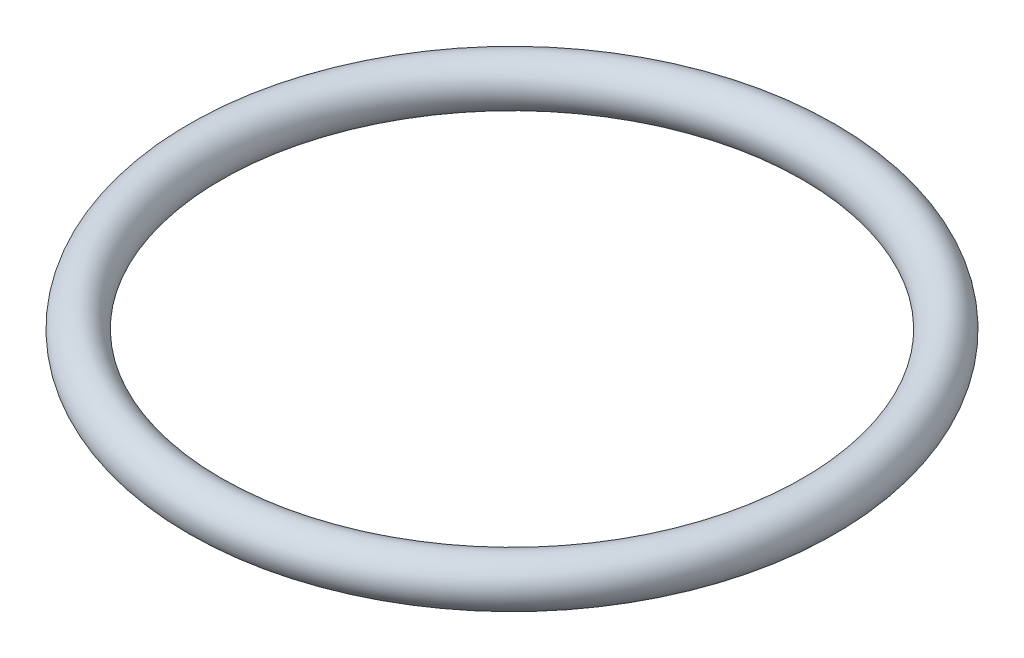
ISO-10303-21;
HEADER;
FILE_DESCRIPTION(('STEP AP214'),'2;1');
FILE_NAME('part.step','',(''),(''),'','','');
FILE_SCHEMA(('AUTOMOTIVE_DESIGN { 1 0 10303 214 1 1 1 1 }'));
ENDSEC;
DATA;
#1=APPLICATION_CONTEXT('core data for automotive mechanical design processes');
#2=APPLICATION_PROTOCOL_DEFINITION('international standard','automotive_design',2000,#1);
#3=PRODUCT_CONTEXT('',#1,'mechanical');
#4=PRODUCT('Part','Part','',(#3));
#5=PRODUCT_RELATED_PRODUCT_CATEGORY('part','',(#4));
#6=PRODUCT_DEFINITION_FORMATION('','',#4);
#7=PRODUCT_DEFINITION_CONTEXT('part definition',#1,'design');
#8=PRODUCT_DEFINITION('design','',#6,#7);
#9=PRODUCT_DEFINITION_SHAPE('','',#8);
#10=(LENGTH_UNIT() NAMED_UNIT(*) SI_UNIT(.MILLI.,.METRE.));
#11=(NAMED_UNIT(*) PLANE_ANGLE_UNIT() SI_UNIT($,.RADIAN.));
#12=(NAMED_UNIT(*) SI_UNIT($,.STERADIAN.) SOLID_ANGLE_UNIT());
#13=UNCERTAINTY_MEASURE_WITH_UNIT(LENGTH_MEASURE(1.E-05),#10,'distance_accuracy_value','');
#14=(GEOMETRIC_REPRESENTATION_CONTEXT(3) GLOBAL_UNCERTAINTY_ASSIGNED_CONTEXT((#13)) GLOBAL_UNIT_ASSIGNED_CONTEXT((#10,
#11,#12)) REPRESENTATION_CONTEXT('',''));
#15=CARTESIAN_POINT('',(0.,0.,0.));
#16=DIRECTION('',(0.,0.,1.));
#17=DIRECTION('',(1.,0.,0.));
#18=AXIS2_PLACEMENT_3D('',#15,#16,#17);
#19=CARTESIAN_POINT('',(0.,0.,0.));
#20=DIRECTION('',(0.,-1.,0.));
#21=DIRECTION('',(0.,0.,-1.));
#22=AXIS2_PLACEMENT_3D('',#19,#20,#21);
#23=TOROIDAL_SURFACE('',#22,23.7871,1.7653);
#24=CARTESIAN_POINT('',(0.,0.,-25.5524));
#25=VERTEX_POINT('',#24);
#26=VERTEX_LOOP('',#25);
#27=FACE_BOUND('',#26,.T.);
#28=ADVANCED_FACE('F29',(#27),#23,.T.);
#29=CLOSED_SHELL('',(#28));
#30=MANIFOLD_SOLID_BREP('B2',#29);
#31=ADVANCED_BREP_SHAPE_REPRESENTATION('',(#18,#30),#14);
#32=SHAPE_DEFINITION_REPRESENTATION(#9,#31);
ENDSEC;
END-ISO-10303-21;
